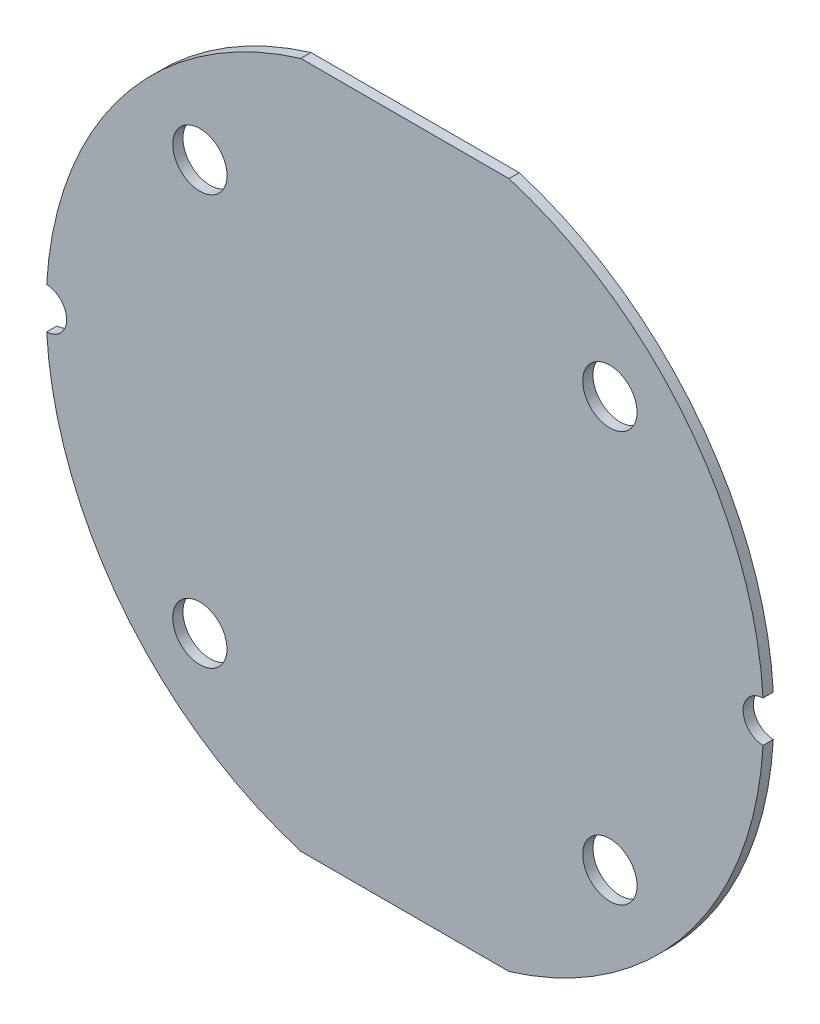
ISO-10303-21;
HEADER;
FILE_DESCRIPTION(('STEP AP214'),'2;1');
FILE_NAME('part.step','',(''),(''),'','','');
FILE_SCHEMA(('AUTOMOTIVE_DESIGN { 1 0 10303 214 1 1 1 1 }'));
ENDSEC;
DATA;
#1=APPLICATION_CONTEXT('core data for automotive mechanical design processes');
#2=APPLICATION_PROTOCOL_DEFINITION('international standard','automotive_design',2000,#1);
#3=PRODUCT_CONTEXT('',#1,'mechanical');
#4=PRODUCT('Part','Part','',(#3));
#5=PRODUCT_RELATED_PRODUCT_CATEGORY('part','',(#4));
#6=PRODUCT_DEFINITION_FORMATION('','',#4);
#7=PRODUCT_DEFINITION_CONTEXT('part definition',#1,'design');
#8=PRODUCT_DEFINITION('design','',#6,#7);
#9=PRODUCT_DEFINITION_SHAPE('','',#8);
#10=(LENGTH_UNIT() NAMED_UNIT(*) SI_UNIT(.MILLI.,.METRE.));
#11=(NAMED_UNIT(*) PLANE_ANGLE_UNIT() SI_UNIT($,.RADIAN.));
#12=(NAMED_UNIT(*) SI_UNIT($,.STERADIAN.) SOLID_ANGLE_UNIT());
#13=UNCERTAINTY_MEASURE_WITH_UNIT(LENGTH_MEASURE(1.E-05),#10,'distance_accuracy_value','');
#14=(GEOMETRIC_REPRESENTATION_CONTEXT(3) GLOBAL_UNCERTAINTY_ASSIGNED_CONTEXT((#13)) GLOBAL_UNIT_ASSIGNED_CONTEXT((#10,
#11,#12)) REPRESENTATION_CONTEXT('',''));
#15=CARTESIAN_POINT('',(0.,0.,0.));
#16=DIRECTION('',(0.,0.,1.));
#17=DIRECTION('',(1.,0.,0.));
#18=AXIS2_PLACEMENT_3D('',#15,#16,#17);
#19=CARTESIAN_POINT('',(0.,0.,1.));
#20=DIRECTION('',(0.,0.,1.));
#21=DIRECTION('',(1.,0.,0.));
#22=AXIS2_PLACEMENT_3D('',#19,#20,#21);
#23=PLANE('',#22);
#24=CARTESIAN_POINT('',(20.,-20.,1.));
#25=DIRECTION('',(0.,0.,1.));
#26=DIRECTION('',(1.,0.,0.));
#27=AXIS2_PLACEMENT_3D('',#24,#25,#26);
#28=CIRCLE('',#27,2.65);
#29=CARTESIAN_POINT('',(22.65,-20.,1.));
#30=VERTEX_POINT('',#29);
#31=EDGE_CURVE('E188',#30,#30,#28,.T.);
#32=ORIENTED_EDGE('',*,*,#31,.F.);
#33=EDGE_LOOP('',(#32));
#34=FACE_BOUND('',#33,.T.);
#35=CARTESIAN_POINT('',(-20.,20.,1.));
#36=DIRECTION('',(0.,0.,1.));
#37=DIRECTION('',(1.,0.,0.));
#38=AXIS2_PLACEMENT_3D('',#35,#36,#37);
#39=CIRCLE('',#38,2.65);
#40=CARTESIAN_POINT('',(-17.35,20.,1.));
#41=VERTEX_POINT('',#40);
#42=EDGE_CURVE('E134',#41,#41,#39,.T.);
#43=ORIENTED_EDGE('',*,*,#42,.F.);
#44=EDGE_LOOP('',(#43));
#45=FACE_BOUND('',#44,.T.);
#46=CARTESIAN_POINT('',(0.,0.,1.));
#47=DIRECTION('',(0.,0.,1.));
#48=DIRECTION('',(1.,0.,0.));
#49=AXIS2_PLACEMENT_3D('',#46,#47,#48);
#50=CIRCLE('',#49,35.);
#51=CARTESIAN_POINT('',(-34.9428104193123,-2.,1.));
#52=VERTEX_POINT('',#51);
#53=CARTESIAN_POINT('',(-10.16,-33.4929007403061,1.));
#54=VERTEX_POINT('',#53);
#55=EDGE_CURVE('E145',#52,#54,#50,.T.);
#56=ORIENTED_EDGE('',*,*,#55,.T.);
#57=DIRECTION('',(1.,0.,0.));
#58=VECTOR('',#57,1.);
#59=CARTESIAN_POINT('',(-10.16,-33.4929007403061,1.));
#60=LINE('',#59,#58);
#61=CARTESIAN_POINT('',(10.16,-33.4929007403061,1.));
#62=VERTEX_POINT('',#61);
#63=EDGE_CURVE('E93',#54,#62,#60,.T.);
#64=ORIENTED_EDGE('',*,*,#63,.T.);
#65=CARTESIAN_POINT('',(0.,0.,1.));
#66=DIRECTION('',(0.,0.,1.));
#67=DIRECTION('',(1.,0.,0.));
#68=AXIS2_PLACEMENT_3D('',#65,#66,#67);
#69=CIRCLE('',#68,35.);
#70=CARTESIAN_POINT('',(34.9428104193123,-2.00000000000002,1.));
#71=VERTEX_POINT('',#70);
#72=EDGE_CURVE('E160',#62,#71,#69,.T.);
#73=ORIENTED_EDGE('',*,*,#72,.T.);
#74=CARTESIAN_POINT('',(35.,0.,1.));
#75=DIRECTION('',(0.,0.,-1.));
#76=DIRECTION('',(1.,0.,0.));
#77=AXIS2_PLACEMENT_3D('',#74,#75,#76);
#78=CIRCLE('',#77,2.00081749496031);
#79=CARTESIAN_POINT('',(34.9428104193123,2.,1.));
#80=VERTEX_POINT('',#79);
#81=EDGE_CURVE('E173',#71,#80,#78,.T.);
#82=ORIENTED_EDGE('',*,*,#81,.T.);
#83=CARTESIAN_POINT('',(0.,0.,1.));
#84=DIRECTION('',(0.,0.,1.));
#85=DIRECTION('',(1.,0.,0.));
#86=AXIS2_PLACEMENT_3D('',#83,#84,#85);
#87=CIRCLE('',#86,35.);
#88=CARTESIAN_POINT('',(10.16,33.4929007403061,1.));
#89=VERTEX_POINT('',#88);
#90=EDGE_CURVE('E112',#80,#89,#87,.T.);
#91=ORIENTED_EDGE('',*,*,#90,.T.);
#92=DIRECTION('',(-1.,0.,0.));
#93=VECTOR('',#92,1.);
#94=CARTESIAN_POINT('',(-10.16,33.4929007403061,1.));
#95=LINE('',#94,#93);
#96=CARTESIAN_POINT('',(-10.16,33.4929007403061,1.));
#97=VERTEX_POINT('',#96);
#98=EDGE_CURVE('E106',#89,#97,#95,.T.);
#99=ORIENTED_EDGE('',*,*,#98,.T.);
#100=CARTESIAN_POINT('',(0.,0.,1.));
#101=DIRECTION('',(0.,0.,1.));
#102=DIRECTION('',(1.,0.,0.));
#103=AXIS2_PLACEMENT_3D('',#100,#101,#102);
#104=CIRCLE('',#103,35.);
#105=CARTESIAN_POINT('',(-34.9428104193123,2.,1.));
#106=VERTEX_POINT('',#105);
#107=EDGE_CURVE('E110',#97,#106,#104,.T.);
#108=ORIENTED_EDGE('',*,*,#107,.T.);
#109=CARTESIAN_POINT('',(-35.,0.,1.));
#110=DIRECTION('',(0.,0.,-1.));
#111=DIRECTION('',(-1.,0.,0.));
#112=AXIS2_PLACEMENT_3D('',#109,#110,#111);
#113=CIRCLE('',#112,2.00081749496031);
#114=EDGE_CURVE('E50',#106,#52,#113,.T.);
#115=ORIENTED_EDGE('',*,*,#114,.T.);
#116=EDGE_LOOP('',(#56,#64,#73,#82,#91,#99,#108,#115));
#117=FACE_BOUND('',#116,.T.);
#118=CARTESIAN_POINT('',(-20.,-20.,1.));
#119=DIRECTION('',(0.,0.,1.));
#120=DIRECTION('',(-1.,0.,0.));
#121=AXIS2_PLACEMENT_3D('',#118,#119,#120);
#122=CIRCLE('',#121,2.65);
#123=CARTESIAN_POINT('',(-22.65,-20.,1.));
#124=VERTEX_POINT('',#123);
#125=EDGE_CURVE('E182',#124,#124,#122,.T.);
#126=ORIENTED_EDGE('',*,*,#125,.F.);
#127=EDGE_LOOP('',(#126));
#128=FACE_BOUND('',#127,.T.);
#129=CARTESIAN_POINT('',(20.,20.,1.));
#130=DIRECTION('',(0.,0.,1.));
#131=DIRECTION('',(-1.,0.,0.));
#132=AXIS2_PLACEMENT_3D('',#129,#130,#131);
#133=CIRCLE('',#132,2.65);
#134=CARTESIAN_POINT('',(17.35,20.,1.));
#135=VERTEX_POINT('',#134);
#136=EDGE_CURVE('E194',#135,#135,#133,.T.);
#137=ORIENTED_EDGE('',*,*,#136,.F.);
#138=EDGE_LOOP('',(#137));
#139=FACE_BOUND('',#138,.T.);
#140=ADVANCED_FACE('F33',(#34,#45,#117,#128,#139),#23,.T.);
#141=CARTESIAN_POINT('',(0.,0.,0.));
#142=DIRECTION('',(0.,0.,1.));
#143=DIRECTION('',(1.,0.,0.));
#144=AXIS2_PLACEMENT_3D('',#141,#142,#143);
#145=PLANE('',#144);
#146=CARTESIAN_POINT('',(0.,0.,0.));
#147=DIRECTION('',(0.,0.,1.));
#148=DIRECTION('',(1.,0.,0.));
#149=AXIS2_PLACEMENT_3D('',#146,#147,#148);
#150=CIRCLE('',#149,35.);
#151=CARTESIAN_POINT('',(-34.9428104193123,-2.,0.));
#152=VERTEX_POINT('',#151);
#153=CARTESIAN_POINT('',(-10.16,-33.4929007403061,0.));
#154=VERTEX_POINT('',#153);
#155=EDGE_CURVE('E130',#152,#154,#150,.T.);
#156=ORIENTED_EDGE('',*,*,#155,.F.);
#157=CARTESIAN_POINT('',(-35.,0.,0.));
#158=DIRECTION('',(0.,0.,-1.));
#159=DIRECTION('',(-1.,0.,0.));
#160=AXIS2_PLACEMENT_3D('',#157,#158,#159);
#161=CIRCLE('',#160,2.00081749496031);
#162=CARTESIAN_POINT('',(-34.9428104193123,2.,0.));
#163=VERTEX_POINT('',#162);
#164=EDGE_CURVE('E85',#163,#152,#161,.T.);
#165=ORIENTED_EDGE('',*,*,#164,.F.);
#166=CARTESIAN_POINT('',(0.,0.,0.));
#167=DIRECTION('',(0.,0.,1.));
#168=DIRECTION('',(1.,0.,0.));
#169=AXIS2_PLACEMENT_3D('',#166,#167,#168);
#170=CIRCLE('',#169,35.);
#171=CARTESIAN_POINT('',(-10.16,33.4929007403061,0.));
#172=VERTEX_POINT('',#171);
#173=EDGE_CURVE('E79',#172,#163,#170,.T.);
#174=ORIENTED_EDGE('',*,*,#173,.F.);
#175=DIRECTION('',(-1.,0.,0.));
#176=VECTOR('',#175,1.);
#177=CARTESIAN_POINT('',(-10.16,33.4929007403061,0.));
#178=LINE('',#177,#176);
#179=CARTESIAN_POINT('',(10.16,33.4929007403061,0.));
#180=VERTEX_POINT('',#179);
#181=EDGE_CURVE('E120',#180,#172,#178,.T.);
#182=ORIENTED_EDGE('',*,*,#181,.F.);
#183=CARTESIAN_POINT('',(0.,0.,0.));
#184=DIRECTION('',(0.,0.,1.));
#185=DIRECTION('',(1.,0.,0.));
#186=AXIS2_PLACEMENT_3D('',#183,#184,#185);
#187=CIRCLE('',#186,35.);
#188=CARTESIAN_POINT('',(34.9428104193123,2.,0.));
#189=VERTEX_POINT('',#188);
#190=EDGE_CURVE('E140',#189,#180,#187,.T.);
#191=ORIENTED_EDGE('',*,*,#190,.F.);
#192=CARTESIAN_POINT('',(35.,0.,0.));
#193=DIRECTION('',(0.,0.,-1.));
#194=DIRECTION('',(1.,0.,0.));
#195=AXIS2_PLACEMENT_3D('',#192,#193,#194);
#196=CIRCLE('',#195,2.00081749496031);
#197=CARTESIAN_POINT('',(34.9428104193123,-2.00000000000002,0.));
#198=VERTEX_POINT('',#197);
#199=EDGE_CURVE('E138',#198,#189,#196,.T.);
#200=ORIENTED_EDGE('',*,*,#199,.F.);
#201=CARTESIAN_POINT('',(0.,0.,0.));
#202=DIRECTION('',(0.,0.,1.));
#203=DIRECTION('',(1.,0.,0.));
#204=AXIS2_PLACEMENT_3D('',#201,#202,#203);
#205=CIRCLE('',#204,35.);
#206=CARTESIAN_POINT('',(10.16,-33.4929007403061,0.));
#207=VERTEX_POINT('',#206);
#208=EDGE_CURVE('E136',#207,#198,#205,.T.);
#209=ORIENTED_EDGE('',*,*,#208,.F.);
#210=DIRECTION('',(1.,0.,0.));
#211=VECTOR('',#210,1.);
#212=CARTESIAN_POINT('',(-10.16,-33.4929007403061,0.));
#213=LINE('',#212,#211);
#214=EDGE_CURVE('E133',#154,#207,#213,.T.);
#215=ORIENTED_EDGE('',*,*,#214,.F.);
#216=EDGE_LOOP('',(#156,#165,#174,#182,#191,#200,#209,#215));
#217=FACE_BOUND('',#216,.T.);
#218=CARTESIAN_POINT('',(-20.,20.,0.));
#219=DIRECTION('',(0.,0.,1.));
#220=DIRECTION('',(1.,0.,0.));
#221=AXIS2_PLACEMENT_3D('',#218,#219,#220);
#222=CIRCLE('',#221,2.65);
#223=CARTESIAN_POINT('',(-17.35,20.,0.));
#224=VERTEX_POINT('',#223);
#225=EDGE_CURVE('E179',#224,#224,#222,.T.);
#226=ORIENTED_EDGE('',*,*,#225,.T.);
#227=EDGE_LOOP('',(#226));
#228=FACE_BOUND('',#227,.T.);
#229=CARTESIAN_POINT('',(-20.,-20.,0.));
#230=DIRECTION('',(0.,0.,1.));
#231=DIRECTION('',(-1.,0.,0.));
#232=AXIS2_PLACEMENT_3D('',#229,#230,#231);
#233=CIRCLE('',#232,2.65);
#234=CARTESIAN_POINT('',(-22.65,-20.,0.));
#235=VERTEX_POINT('',#234);
#236=EDGE_CURVE('E185',#235,#235,#233,.T.);
#237=ORIENTED_EDGE('',*,*,#236,.T.);
#238=EDGE_LOOP('',(#237));
#239=FACE_BOUND('',#238,.T.);
#240=CARTESIAN_POINT('',(20.,-20.,0.));
#241=DIRECTION('',(0.,0.,1.));
#242=DIRECTION('',(1.,0.,0.));
#243=AXIS2_PLACEMENT_3D('',#240,#241,#242);
#244=CIRCLE('',#243,2.65);
#245=CARTESIAN_POINT('',(22.65,-20.,0.));
#246=VERTEX_POINT('',#245);
#247=EDGE_CURVE('E191',#246,#246,#244,.T.);
#248=ORIENTED_EDGE('',*,*,#247,.T.);
#249=EDGE_LOOP('',(#248));
#250=FACE_BOUND('',#249,.T.);
#251=CARTESIAN_POINT('',(20.,20.,0.));
#252=DIRECTION('',(0.,0.,1.));
#253=DIRECTION('',(-1.,0.,0.));
#254=AXIS2_PLACEMENT_3D('',#251,#252,#253);
#255=CIRCLE('',#254,2.65);
#256=CARTESIAN_POINT('',(17.35,20.,0.));
#257=VERTEX_POINT('',#256);
#258=EDGE_CURVE('E197',#257,#257,#255,.T.);
#259=ORIENTED_EDGE('',*,*,#258,.T.);
#260=EDGE_LOOP('',(#259));
#261=FACE_BOUND('',#260,.T.);
#262=ADVANCED_FACE('F164',(#217,#228,#239,#250,#261),#145,.F.);
#263=CARTESIAN_POINT('',(0.,0.,1.));
#264=DIRECTION('',(0.,0.,-1.));
#265=DIRECTION('',(-1.,0.,0.));
#266=AXIS2_PLACEMENT_3D('',#263,#264,#265);
#267=CYLINDRICAL_SURFACE('',#266,35.);
#268=ORIENTED_EDGE('',*,*,#155,.T.);
#269=DIRECTION('',(0.,0.,-1.));
#270=VECTOR('',#269,1.);
#271=CARTESIAN_POINT('',(-10.16,-33.4929007403061,1.));
#272=LINE('',#271,#270);
#273=EDGE_CURVE('E11',#54,#154,#272,.T.);
#274=ORIENTED_EDGE('',*,*,#273,.F.);
#275=ORIENTED_EDGE('',*,*,#55,.F.);
#276=DIRECTION('',(0.,0.,-1.));
#277=VECTOR('',#276,1.);
#278=CARTESIAN_POINT('',(-34.9428104193123,-2.,1.));
#279=LINE('',#278,#277);
#280=EDGE_CURVE('E126',#52,#152,#279,.T.);
#281=ORIENTED_EDGE('',*,*,#280,.T.);
#282=EDGE_LOOP('',(#268,#274,#275,#281));
#283=FACE_BOUND('',#282,.T.);
#284=ADVANCED_FACE('F35',(#283),#267,.T.);
#285=CARTESIAN_POINT('',(-10.16,-33.4929007403061,1.));
#286=DIRECTION('',(0.,1.,0.));
#287=DIRECTION('',(0.,0.,1.));
#288=AXIS2_PLACEMENT_3D('',#285,#286,#287);
#289=PLANE('',#288);
#290=ORIENTED_EDGE('',*,*,#214,.T.);
#291=DIRECTION('',(0.,0.,-1.));
#292=VECTOR('',#291,1.);
#293=CARTESIAN_POINT('',(10.16,-33.4929007403061,1.));
#294=LINE('',#293,#292);
#295=EDGE_CURVE('E42',#62,#207,#294,.T.);
#296=ORIENTED_EDGE('',*,*,#295,.F.);
#297=ORIENTED_EDGE('',*,*,#63,.F.);
#298=ORIENTED_EDGE('',*,*,#273,.T.);
#299=EDGE_LOOP('',(#290,#296,#297,#298));
#300=FACE_BOUND('',#299,.T.);
#301=ADVANCED_FACE('F231',(#300),#289,.F.);
#302=CARTESIAN_POINT('',(0.,0.,1.));
#303=DIRECTION('',(0.,0.,-1.));
#304=DIRECTION('',(-1.,0.,0.));
#305=AXIS2_PLACEMENT_3D('',#302,#303,#304);
#306=CYLINDRICAL_SURFACE('',#305,35.);
#307=ORIENTED_EDGE('',*,*,#208,.T.);
#308=DIRECTION('',(0.,0.,-1.));
#309=VECTOR('',#308,1.);
#310=CARTESIAN_POINT('',(34.9428104193123,-2.00000000000002,1.));
#311=LINE('',#310,#309);
#312=EDGE_CURVE('E152',#71,#198,#311,.T.);
#313=ORIENTED_EDGE('',*,*,#312,.F.);
#314=ORIENTED_EDGE('',*,*,#72,.F.);
#315=ORIENTED_EDGE('',*,*,#295,.T.);
#316=EDGE_LOOP('',(#307,#313,#314,#315));
#317=FACE_BOUND('',#316,.T.);
#318=ADVANCED_FACE('F158',(#317),#306,.T.);
#319=CARTESIAN_POINT('',(35.,0.,1.));
#320=DIRECTION('',(0.,0.,-1.));
#321=DIRECTION('',(-1.,0.,0.));
#322=AXIS2_PLACEMENT_3D('',#319,#320,#321);
#323=CYLINDRICAL_SURFACE('',#322,2.00081749496031);
#324=ORIENTED_EDGE('',*,*,#199,.T.);
#325=DIRECTION('',(0.,0.,-1.));
#326=VECTOR('',#325,1.);
#327=CARTESIAN_POINT('',(34.9428104193123,2.,1.));
#328=LINE('',#327,#326);
#329=EDGE_CURVE('E149',#80,#189,#328,.T.);
#330=ORIENTED_EDGE('',*,*,#329,.F.);
#331=ORIENTED_EDGE('',*,*,#81,.F.);
#332=ORIENTED_EDGE('',*,*,#312,.T.);
#333=EDGE_LOOP('',(#324,#330,#331,#332));
#334=FACE_BOUND('',#333,.T.);
#335=ADVANCED_FACE('F169',(#334),#323,.F.);
#336=CARTESIAN_POINT('',(0.,0.,1.));
#337=DIRECTION('',(0.,0.,-1.));
#338=DIRECTION('',(-1.,0.,0.));
#339=AXIS2_PLACEMENT_3D('',#336,#337,#338);
#340=CYLINDRICAL_SURFACE('',#339,35.);
#341=ORIENTED_EDGE('',*,*,#190,.T.);
#342=DIRECTION('',(0.,0.,-1.));
#343=VECTOR('',#342,1.);
#344=CARTESIAN_POINT('',(10.16,33.4929007403061,1.));
#345=LINE('',#344,#343);
#346=EDGE_CURVE('E121',#89,#180,#345,.T.);
#347=ORIENTED_EDGE('',*,*,#346,.F.);
#348=ORIENTED_EDGE('',*,*,#90,.F.);
#349=ORIENTED_EDGE('',*,*,#329,.T.);
#350=EDGE_LOOP('',(#341,#347,#348,#349));
#351=FACE_BOUND('',#350,.T.);
#352=ADVANCED_FACE('F172',(#351),#340,.T.);
#353=CARTESIAN_POINT('',(-10.16,33.4929007403061,1.));
#354=DIRECTION('',(0.,-1.,0.));
#355=DIRECTION('',(0.,0.,-1.));
#356=AXIS2_PLACEMENT_3D('',#353,#354,#355);
#357=PLANE('',#356);
#358=ORIENTED_EDGE('',*,*,#181,.T.);
#359=DIRECTION('',(0.,0.,-1.));
#360=VECTOR('',#359,1.);
#361=CARTESIAN_POINT('',(-10.16,33.4929007403061,1.));
#362=LINE('',#361,#360);
#363=EDGE_CURVE('E117',#97,#172,#362,.T.);
#364=ORIENTED_EDGE('',*,*,#363,.F.);
#365=ORIENTED_EDGE('',*,*,#98,.F.);
#366=ORIENTED_EDGE('',*,*,#346,.T.);
#367=EDGE_LOOP('',(#358,#364,#365,#366));
#368=FACE_BOUND('',#367,.T.);
#369=ADVANCED_FACE('F118',(#368),#357,.F.);
#370=CARTESIAN_POINT('',(0.,0.,1.));
#371=DIRECTION('',(0.,0.,-1.));
#372=DIRECTION('',(-1.,0.,0.));
#373=AXIS2_PLACEMENT_3D('',#370,#371,#372);
#374=CYLINDRICAL_SURFACE('',#373,35.);
#375=ORIENTED_EDGE('',*,*,#173,.T.);
#376=DIRECTION('',(0.,0.,-1.));
#377=VECTOR('',#376,1.);
#378=CARTESIAN_POINT('',(-34.9428104193123,2.,1.));
#379=LINE('',#378,#377);
#380=EDGE_CURVE('E122',#106,#163,#379,.T.);
#381=ORIENTED_EDGE('',*,*,#380,.F.);
#382=ORIENTED_EDGE('',*,*,#107,.F.);
#383=ORIENTED_EDGE('',*,*,#363,.T.);
#384=EDGE_LOOP('',(#375,#381,#382,#383));
#385=FACE_BOUND('',#384,.T.);
#386=ADVANCED_FACE('F124',(#385),#374,.T.);
#387=CARTESIAN_POINT('',(-35.,0.,1.));
#388=DIRECTION('',(0.,0.,-1.));
#389=DIRECTION('',(-1.,0.,0.));
#390=AXIS2_PLACEMENT_3D('',#387,#388,#389);
#391=CYLINDRICAL_SURFACE('',#390,2.00081749496031);
#392=ORIENTED_EDGE('',*,*,#164,.T.);
#393=ORIENTED_EDGE('',*,*,#280,.F.);
#394=ORIENTED_EDGE('',*,*,#114,.F.);
#395=ORIENTED_EDGE('',*,*,#380,.T.);
#396=EDGE_LOOP('',(#392,#393,#394,#395));
#397=FACE_BOUND('',#396,.T.);
#398=ADVANCED_FACE('F219',(#397),#391,.F.);
#399=CARTESIAN_POINT('',(-20.,20.,1.));
#400=DIRECTION('',(0.,0.,-1.));
#401=DIRECTION('',(-1.,0.,0.));
#402=AXIS2_PLACEMENT_3D('',#399,#400,#401);
#403=CYLINDRICAL_SURFACE('',#402,2.65);
#404=ORIENTED_EDGE('',*,*,#42,.T.);
#405=EDGE_LOOP('',(#404));
#406=FACE_BOUND('',#405,.T.);
#407=ORIENTED_EDGE('',*,*,#225,.F.);
#408=EDGE_LOOP('',(#407));
#409=FACE_BOUND('',#408,.T.);
#410=ADVANCED_FACE('F216',(#406,#409),#403,.F.);
#411=CARTESIAN_POINT('',(-20.,-20.,1.));
#412=DIRECTION('',(0.,0.,-1.));
#413=DIRECTION('',(-1.,0.,0.));
#414=AXIS2_PLACEMENT_3D('',#411,#412,#413);
#415=CYLINDRICAL_SURFACE('',#414,2.65);
#416=ORIENTED_EDGE('',*,*,#125,.T.);
#417=EDGE_LOOP('',(#416));
#418=FACE_BOUND('',#417,.T.);
#419=ORIENTED_EDGE('',*,*,#236,.F.);
#420=EDGE_LOOP('',(#419));
#421=FACE_BOUND('',#420,.T.);
#422=ADVANCED_FACE('F295',(#418,#421),#415,.F.);
#423=CARTESIAN_POINT('',(20.,-20.,1.));
#424=DIRECTION('',(0.,0.,-1.));
#425=DIRECTION('',(-1.,0.,0.));
#426=AXIS2_PLACEMENT_3D('',#423,#424,#425);
#427=CYLINDRICAL_SURFACE('',#426,2.65);
#428=ORIENTED_EDGE('',*,*,#31,.T.);
#429=EDGE_LOOP('',(#428));
#430=FACE_BOUND('',#429,.T.);
#431=ORIENTED_EDGE('',*,*,#247,.F.);
#432=EDGE_LOOP('',(#431));
#433=FACE_BOUND('',#432,.T.);
#434=ADVANCED_FACE('F303',(#430,#433),#427,.F.);
#435=CARTESIAN_POINT('',(20.,20.,1.));
#436=DIRECTION('',(0.,0.,-1.));
#437=DIRECTION('',(-1.,0.,0.));
#438=AXIS2_PLACEMENT_3D('',#435,#436,#437);
#439=CYLINDRICAL_SURFACE('',#438,2.65);
#440=ORIENTED_EDGE('',*,*,#136,.T.);
#441=EDGE_LOOP('',(#440));
#442=FACE_BOUND('',#441,.T.);
#443=ORIENTED_EDGE('',*,*,#258,.F.);
#444=EDGE_LOOP('',(#443));
#445=FACE_BOUND('',#444,.T.);
#446=ADVANCED_FACE('F203',(#442,#445),#439,.F.);
#447=CLOSED_SHELL('',(#140,#262,#284,#301,#318,#335,#352,#369,#386,#398,#410,#422,#434,#446));
#448=MANIFOLD_SOLID_BREP('B2',#447);
#449=ADVANCED_BREP_SHAPE_REPRESENTATION('',(#18,#448),#14);
#450=SHAPE_DEFINITION_REPRESENTATION(#9,#449);
ENDSEC;
END-ISO-10303-21;
